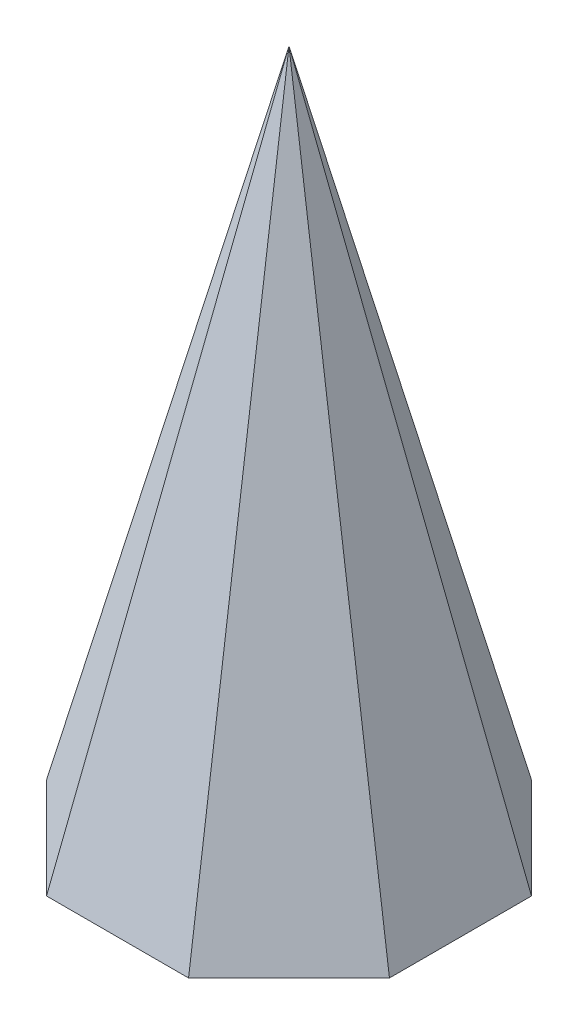
ISO-10303-21;
HEADER;
FILE_DESCRIPTION(('STEP AP214'),'2;1');
FILE_NAME('part.step','',(''),(''),'','','');
FILE_SCHEMA(('AUTOMOTIVE_DESIGN { 1 0 10303 214 1 1 1 1 }'));
ENDSEC;
DATA;
#1=APPLICATION_CONTEXT('core data for automotive mechanical design processes');
#2=APPLICATION_PROTOCOL_DEFINITION('international standard','automotive_design',2000,#1);
#3=PRODUCT_CONTEXT('',#1,'mechanical');
#4=PRODUCT('Part','Part','',(#3));
#5=PRODUCT_RELATED_PRODUCT_CATEGORY('part','',(#4));
#6=PRODUCT_DEFINITION_FORMATION('','',#4);
#7=PRODUCT_DEFINITION_CONTEXT('part definition',#1,'design');
#8=PRODUCT_DEFINITION('design','',#6,#7);
#9=PRODUCT_DEFINITION_SHAPE('','',#8);
#10=(LENGTH_UNIT() NAMED_UNIT(*) SI_UNIT(.MILLI.,.METRE.));
#11=(NAMED_UNIT(*) PLANE_ANGLE_UNIT() SI_UNIT($,.RADIAN.));
#12=(NAMED_UNIT(*) SI_UNIT($,.STERADIAN.) SOLID_ANGLE_UNIT());
#13=UNCERTAINTY_MEASURE_WITH_UNIT(LENGTH_MEASURE(1.E-05),#10,'distance_accuracy_value','');
#14=(GEOMETRIC_REPRESENTATION_CONTEXT(3) GLOBAL_UNCERTAINTY_ASSIGNED_CONTEXT((#13)) GLOBAL_UNIT_ASSIGNED_CONTEXT((#10,
#11,#12)) REPRESENTATION_CONTEXT('',''));
#15=CARTESIAN_POINT('',(0.,0.,0.));
#16=DIRECTION('',(0.,0.,1.));
#17=DIRECTION('',(1.,0.,0.));
#18=AXIS2_PLACEMENT_3D('',#15,#16,#17);
#19=CARTESIAN_POINT('',(-5.,0.,5.));
#20=DIRECTION('',(0.,-1.,0.));
#21=DIRECTION('',(0.,0.,-1.));
#22=AXIS2_PLACEMENT_3D('',#19,#20,#21);
#23=PLANE('',#22);
#24=DIRECTION('',(1.,0.,0.));
#25=VECTOR('',#24,1.);
#26=CARTESIAN_POINT('',(-2.07106781186547,0.,5.));
#27=LINE('',#26,#25);
#28=CARTESIAN_POINT('',(-2.07106781186547,0.,5.));
#29=VERTEX_POINT('',#28);
#30=CARTESIAN_POINT('',(2.07106781186547,0.,5.));
#31=VERTEX_POINT('',#30);
#32=EDGE_CURVE('E86',#29,#31,#27,.T.);
#33=ORIENTED_EDGE('',*,*,#32,.F.);
#34=DIRECTION('',(0.707106781186548,0.,0.707106781186547));
#35=VECTOR('',#34,1.);
#36=CARTESIAN_POINT('',(-5.,0.,2.07106781186547));
#37=LINE('',#36,#35);
#38=CARTESIAN_POINT('',(-5.,0.,2.07106781186547));
#39=VERTEX_POINT('',#38);
#40=EDGE_CURVE('E12',#39,#29,#37,.T.);
#41=ORIENTED_EDGE('',*,*,#40,.F.);
#42=DIRECTION('',(0.,0.,1.));
#43=VECTOR('',#42,1.);
#44=CARTESIAN_POINT('',(-5.,0.,-2.07106781186548));
#45=LINE('',#44,#43);
#46=CARTESIAN_POINT('',(-5.,0.,-2.07106781186548));
#47=VERTEX_POINT('',#46);
#48=EDGE_CURVE('E48',#47,#39,#45,.T.);
#49=ORIENTED_EDGE('',*,*,#48,.F.);
#50=DIRECTION('',(-0.707106781186547,0.,0.707106781186548));
#51=VECTOR('',#50,1.);
#52=CARTESIAN_POINT('',(-2.07106781186548,0.,-5.));
#53=LINE('',#52,#51);
#54=CARTESIAN_POINT('',(-2.07106781186548,0.,-5.));
#55=VERTEX_POINT('',#54);
#56=EDGE_CURVE('E131',#55,#47,#53,.T.);
#57=ORIENTED_EDGE('',*,*,#56,.F.);
#58=DIRECTION('',(-1.,0.,0.));
#59=VECTOR('',#58,1.);
#60=CARTESIAN_POINT('',(2.07106781186548,0.,-5.));
#61=LINE('',#60,#59);
#62=CARTESIAN_POINT('',(2.07106781186548,0.,-5.));
#63=VERTEX_POINT('',#62);
#64=EDGE_CURVE('E122',#63,#55,#61,.T.);
#65=ORIENTED_EDGE('',*,*,#64,.F.);
#66=DIRECTION('',(-0.707106781186548,0.,-0.707106781186547));
#67=VECTOR('',#66,1.);
#68=CARTESIAN_POINT('',(5.,0.,-2.07106781186548));
#69=LINE('',#68,#67);
#70=CARTESIAN_POINT('',(5.,0.,-2.07106781186548));
#71=VERTEX_POINT('',#70);
#72=EDGE_CURVE('E113',#71,#63,#69,.T.);
#73=ORIENTED_EDGE('',*,*,#72,.F.);
#74=DIRECTION('',(0.,0.,-1.));
#75=VECTOR('',#74,1.);
#76=CARTESIAN_POINT('',(5.,0.,2.07106781186547));
#77=LINE('',#76,#75);
#78=CARTESIAN_POINT('',(5.,0.,2.07106781186547));
#79=VERTEX_POINT('',#78);
#80=EDGE_CURVE('E104',#79,#71,#77,.T.);
#81=ORIENTED_EDGE('',*,*,#80,.F.);
#82=DIRECTION('',(0.707106781186547,0.,-0.707106781186547));
#83=VECTOR('',#82,1.);
#84=CARTESIAN_POINT('',(2.07106781186547,0.,5.));
#85=LINE('',#84,#83);
#86=EDGE_CURVE('E95',#31,#79,#85,.T.);
#87=ORIENTED_EDGE('',*,*,#86,.F.);
#88=EDGE_LOOP('',(#33,#41,#49,#57,#65,#73,#81,#87));
#89=FACE_BOUND('',#88,.T.);
#90=ADVANCED_FACE('F38',(#89),#23,.T.);
#91=CARTESIAN_POINT('',(-5.,0.,-2.07106781186547));
#92=DIRECTION('',(-0.970142500145332,0.242535625036333,0.));
#93=DIRECTION('',(-0.242535625036333,-0.970142500145332,0.));
#94=AXIS2_PLACEMENT_3D('',#91,#92,#93);
#95=PLANE('',#94);
#96=DIRECTION('',(-0.241320913891638,-0.965283655566552,-0.0999583954181863));
#97=VECTOR('',#96,1.);
#98=CARTESIAN_POINT('',(0.,20.,0.));
#99=LINE('',#98,#97);
#100=CARTESIAN_POINT('',(0.,20.,0.));
#101=VERTEX_POINT('',#100);
#102=EDGE_CURVE('E126',#101,#47,#99,.T.);
#103=ORIENTED_EDGE('',*,*,#102,.T.);
#104=ORIENTED_EDGE('',*,*,#48,.T.);
#105=DIRECTION('',(-0.241320913891638,-0.965283655566552,0.0999583954181863));
#106=VECTOR('',#105,1.);
#107=CARTESIAN_POINT('',(0.,20.,0.));
#108=LINE('',#107,#106);
#109=EDGE_CURVE('E134',#101,#39,#108,.T.);
#110=ORIENTED_EDGE('',*,*,#109,.F.);
#111=EDGE_LOOP('',(#103,#104,#110));
#112=FACE_BOUND('',#111,.T.);
#113=ADVANCED_FACE('F137',(#112),#95,.T.);
#114=CARTESIAN_POINT('',(-5.,0.,2.07106781186548));
#115=DIRECTION('',(-0.685994340570035,0.242535625036333,0.685994340570035));
#116=DIRECTION('',(0.707106781186548,0.,0.707106781186547));
#117=AXIS2_PLACEMENT_3D('',#114,#115,#116);
#118=PLANE('',#117);
#119=ORIENTED_EDGE('',*,*,#109,.T.);
#120=ORIENTED_EDGE('',*,*,#40,.T.);
#121=DIRECTION('',(-0.0999583954181863,-0.965283655566552,0.241320913891638));
#122=VECTOR('',#121,1.);
#123=CARTESIAN_POINT('',(0.,20.,0.));
#124=LINE('',#123,#122);
#125=EDGE_CURVE('E56',#101,#29,#124,.T.);
#126=ORIENTED_EDGE('',*,*,#125,.F.);
#127=EDGE_LOOP('',(#119,#120,#126));
#128=FACE_BOUND('',#127,.T.);
#129=ADVANCED_FACE('F141',(#128),#118,.T.);
#130=CARTESIAN_POINT('',(-2.07106781186548,0.,-5.));
#131=DIRECTION('',(-0.685994340570035,0.242535625036333,-0.685994340570035));
#132=DIRECTION('',(-0.707106781186547,0.,0.707106781186548));
#133=AXIS2_PLACEMENT_3D('',#130,#131,#132);
#134=PLANE('',#133);
#135=DIRECTION('',(-0.0999583954181864,-0.965283655566552,-0.241320913891638));
#136=VECTOR('',#135,1.);
#137=CARTESIAN_POINT('',(0.,20.,0.));
#138=LINE('',#137,#136);
#139=EDGE_CURVE('E117',#101,#55,#138,.T.);
#140=ORIENTED_EDGE('',*,*,#139,.T.);
#141=ORIENTED_EDGE('',*,*,#56,.T.);
#142=ORIENTED_EDGE('',*,*,#102,.F.);
#143=EDGE_LOOP('',(#140,#141,#142));
#144=FACE_BOUND('',#143,.T.);
#145=ADVANCED_FACE('F130',(#144),#134,.T.);
#146=CARTESIAN_POINT('',(2.07106781186548,0.,-5.));
#147=DIRECTION('',(0.,0.242535625036333,-0.970142500145332));
#148=DIRECTION('',(0.,0.970142500145332,0.242535625036333));
#149=AXIS2_PLACEMENT_3D('',#146,#147,#148);
#150=PLANE('',#149);
#151=DIRECTION('',(0.0999583954181863,-0.965283655566552,-0.241320913891638));
#152=VECTOR('',#151,1.);
#153=CARTESIAN_POINT('',(0.,20.,0.));
#154=LINE('',#153,#152);
#155=EDGE_CURVE('E108',#101,#63,#154,.T.);
#156=ORIENTED_EDGE('',*,*,#155,.T.);
#157=ORIENTED_EDGE('',*,*,#64,.T.);
#158=ORIENTED_EDGE('',*,*,#139,.F.);
#159=EDGE_LOOP('',(#156,#157,#158));
#160=FACE_BOUND('',#159,.T.);
#161=ADVANCED_FACE('F121',(#160),#150,.T.);
#162=CARTESIAN_POINT('',(5.,0.,-2.07106781186548));
#163=DIRECTION('',(0.685994340570035,0.242535625036333,-0.685994340570035));
#164=DIRECTION('',(-0.707106781186548,0.,-0.707106781186547));
#165=AXIS2_PLACEMENT_3D('',#162,#163,#164);
#166=PLANE('',#165);
#167=DIRECTION('',(0.241320913891638,-0.965283655566552,-0.0999583954181865));
#168=VECTOR('',#167,1.);
#169=CARTESIAN_POINT('',(0.,20.,0.));
#170=LINE('',#169,#168);
#171=EDGE_CURVE('E99',#101,#71,#170,.T.);
#172=ORIENTED_EDGE('',*,*,#171,.T.);
#173=ORIENTED_EDGE('',*,*,#72,.T.);
#174=ORIENTED_EDGE('',*,*,#155,.F.);
#175=EDGE_LOOP('',(#172,#173,#174));
#176=FACE_BOUND('',#175,.T.);
#177=ADVANCED_FACE('F112',(#176),#166,.T.);
#178=CARTESIAN_POINT('',(5.,0.,2.07106781186547));
#179=DIRECTION('',(0.970142500145332,0.242535625036333,0.));
#180=DIRECTION('',(-0.242535625036333,0.970142500145332,0.));
#181=AXIS2_PLACEMENT_3D('',#178,#179,#180);
#182=PLANE('',#181);
#183=DIRECTION('',(0.241320913891638,-0.965283655566552,0.0999583954181863));
#184=VECTOR('',#183,1.);
#185=CARTESIAN_POINT('',(0.,20.,0.));
#186=LINE('',#185,#184);
#187=EDGE_CURVE('E90',#101,#79,#186,.T.);
#188=ORIENTED_EDGE('',*,*,#187,.T.);
#189=ORIENTED_EDGE('',*,*,#80,.T.);
#190=ORIENTED_EDGE('',*,*,#171,.F.);
#191=EDGE_LOOP('',(#188,#189,#190));
#192=FACE_BOUND('',#191,.T.);
#193=ADVANCED_FACE('F103',(#192),#182,.T.);
#194=CARTESIAN_POINT('',(2.07106781186547,0.,5.));
#195=DIRECTION('',(0.685994340570035,0.242535625036333,0.685994340570035));
#196=DIRECTION('',(0.707106781186548,0.,-0.707106781186548));
#197=AXIS2_PLACEMENT_3D('',#194,#195,#196);
#198=PLANE('',#197);
#199=DIRECTION('',(0.0999583954181862,-0.965283655566552,0.241320913891638));
#200=VECTOR('',#199,1.);
#201=CARTESIAN_POINT('',(0.,20.,0.));
#202=LINE('',#201,#200);
#203=EDGE_CURVE('E83',#101,#31,#202,.T.);
#204=ORIENTED_EDGE('',*,*,#203,.T.);
#205=ORIENTED_EDGE('',*,*,#86,.T.);
#206=ORIENTED_EDGE('',*,*,#187,.F.);
#207=EDGE_LOOP('',(#204,#205,#206));
#208=FACE_BOUND('',#207,.T.);
#209=ADVANCED_FACE('F94',(#208),#198,.T.);
#210=CARTESIAN_POINT('',(-2.07106781186547,0.,5.));
#211=DIRECTION('',(0.,0.242535625036333,0.970142500145332));
#212=DIRECTION('',(0.,-0.970142500145332,0.242535625036333));
#213=AXIS2_PLACEMENT_3D('',#210,#211,#212);
#214=PLANE('',#213);
#215=ORIENTED_EDGE('',*,*,#125,.T.);
#216=ORIENTED_EDGE('',*,*,#32,.T.);
#217=ORIENTED_EDGE('',*,*,#203,.F.);
#218=EDGE_LOOP('',(#215,#216,#217));
#219=FACE_BOUND('',#218,.T.);
#220=ADVANCED_FACE('F85',(#219),#214,.T.);
#221=CLOSED_SHELL('',(#90,#113,#129,#145,#161,#177,#193,#209,#220));
#222=MANIFOLD_SOLID_BREP('B2',#221);
#223=ADVANCED_BREP_SHAPE_REPRESENTATION('',(#18,#222),#14);
#224=SHAPE_DEFINITION_REPRESENTATION(#9,#223);
ENDSEC;
END-ISO-10303-21;
